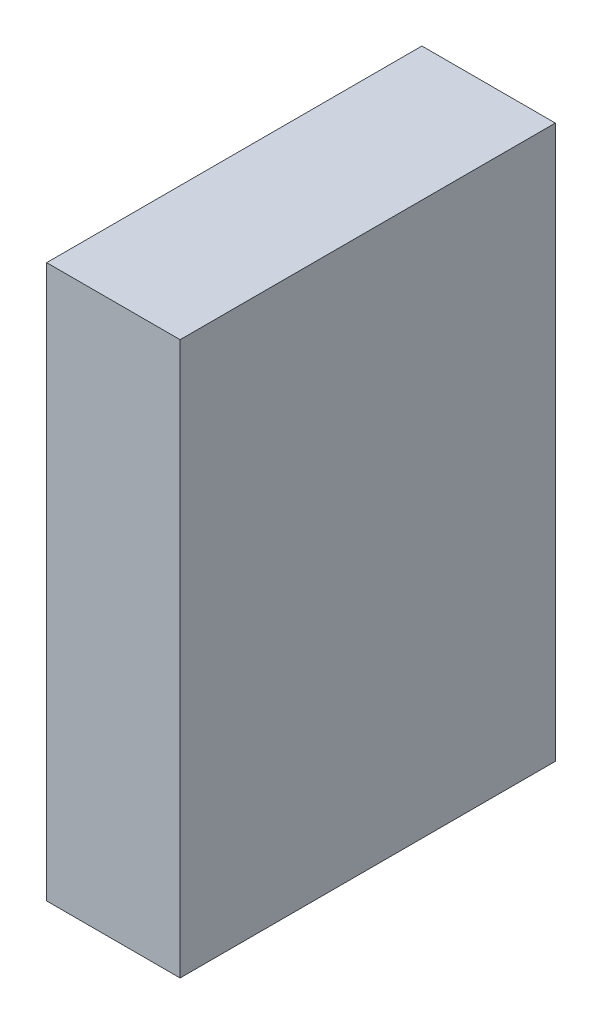
ISO-10303-21;
HEADER;
FILE_DESCRIPTION(('STEP AP214'),'2;1');
FILE_NAME('part.step','',(''),(''),'','','');
FILE_SCHEMA(('AUTOMOTIVE_DESIGN { 1 0 10303 214 1 1 1 1 }'));
ENDSEC;
DATA;
#1=APPLICATION_CONTEXT('core data for automotive mechanical design processes');
#2=APPLICATION_PROTOCOL_DEFINITION('international standard','automotive_design',2000,#1);
#3=PRODUCT_CONTEXT('',#1,'mechanical');
#4=PRODUCT('Part','Part','',(#3));
#5=PRODUCT_RELATED_PRODUCT_CATEGORY('part','',(#4));
#6=PRODUCT_DEFINITION_FORMATION('','',#4);
#7=PRODUCT_DEFINITION_CONTEXT('part definition',#1,'design');
#8=PRODUCT_DEFINITION('design','',#6,#7);
#9=PRODUCT_DEFINITION_SHAPE('','',#8);
#10=(LENGTH_UNIT() NAMED_UNIT(*) SI_UNIT(.MILLI.,.METRE.));
#11=(NAMED_UNIT(*) PLANE_ANGLE_UNIT() SI_UNIT($,.RADIAN.));
#12=(NAMED_UNIT(*) SI_UNIT($,.STERADIAN.) SOLID_ANGLE_UNIT());
#13=UNCERTAINTY_MEASURE_WITH_UNIT(LENGTH_MEASURE(1.E-05),#10,'distance_accuracy_value','');
#14=(GEOMETRIC_REPRESENTATION_CONTEXT(3) GLOBAL_UNCERTAINTY_ASSIGNED_CONTEXT((#13)) GLOBAL_UNIT_ASSIGNED_CONTEXT((#10,
#11,#12)) REPRESENTATION_CONTEXT('',''));
#15=CARTESIAN_POINT('',(0.,0.,0.));
#16=DIRECTION('',(0.,0.,1.));
#17=DIRECTION('',(1.,0.,0.));
#18=AXIS2_PLACEMENT_3D('',#15,#16,#17);
#19=CARTESIAN_POINT('',(0.,0.,1.00000054));
#20=DIRECTION('',(0.,0.,1.));
#21=DIRECTION('',(1.,0.,0.));
#22=AXIS2_PLACEMENT_3D('',#19,#20,#21);
#23=PLANE('',#22);
#24=DIRECTION('',(0.,-1.,0.));
#25=VECTOR('',#24,1.);
#26=CARTESIAN_POINT('',(-0.1778,0.7366,1.00000054));
#27=LINE('',#26,#25);
#28=CARTESIAN_POINT('',(-0.1778,0.7366,1.00000054));
#29=VERTEX_POINT('',#28);
#30=CARTESIAN_POINT('',(-0.1778,-0.7366,1.00000054));
#31=VERTEX_POINT('',#30);
#32=EDGE_CURVE('E82',#29,#31,#27,.T.);
#33=ORIENTED_EDGE('',*,*,#32,.T.);
#34=DIRECTION('',(1.,0.,0.));
#35=VECTOR('',#34,1.);
#36=CARTESIAN_POINT('',(-0.1778,-0.7366,1.00000054));
#37=LINE('',#36,#35);
#38=CARTESIAN_POINT('',(0.1778,-0.7366,1.00000054));
#39=VERTEX_POINT('',#38);
#40=EDGE_CURVE('E104',#31,#39,#37,.T.);
#41=ORIENTED_EDGE('',*,*,#40,.T.);
#42=DIRECTION('',(0.,1.,0.));
#43=VECTOR('',#42,1.);
#44=CARTESIAN_POINT('',(0.1778,-0.7366,1.00000054));
#45=LINE('',#44,#43);
#46=CARTESIAN_POINT('',(0.1778,0.7366,1.00000054));
#47=VERTEX_POINT('',#46);
#48=EDGE_CURVE('E75',#39,#47,#45,.T.);
#49=ORIENTED_EDGE('',*,*,#48,.T.);
#50=DIRECTION('',(-1.,0.,0.));
#51=VECTOR('',#50,1.);
#52=CARTESIAN_POINT('',(0.1778,0.7366,1.00000054));
#53=LINE('',#52,#51);
#54=EDGE_CURVE('E11',#47,#29,#53,.T.);
#55=ORIENTED_EDGE('',*,*,#54,.T.);
#56=EDGE_LOOP('',(#33,#41,#49,#55));
#57=FACE_BOUND('',#56,.T.);
#58=ADVANCED_FACE('F17',(#57),#23,.T.);
#59=CARTESIAN_POINT('',(0.,0.,0.));
#60=DIRECTION('',(0.,0.,1.));
#61=DIRECTION('',(1.,0.,0.));
#62=AXIS2_PLACEMENT_3D('',#59,#60,#61);
#63=PLANE('',#62);
#64=DIRECTION('',(-1.,0.,0.));
#65=VECTOR('',#64,1.);
#66=CARTESIAN_POINT('',(0.1778,0.7366,0.));
#67=LINE('',#66,#65);
#68=CARTESIAN_POINT('',(0.1778,0.7366,0.));
#69=VERTEX_POINT('',#68);
#70=CARTESIAN_POINT('',(-0.1778,0.7366,0.));
#71=VERTEX_POINT('',#70);
#72=EDGE_CURVE('E20',#69,#71,#67,.T.);
#73=ORIENTED_EDGE('',*,*,#72,.F.);
#74=DIRECTION('',(0.,1.,0.));
#75=VECTOR('',#74,1.);
#76=CARTESIAN_POINT('',(0.1778,-0.7366,0.));
#77=LINE('',#76,#75);
#78=CARTESIAN_POINT('',(0.1778,-0.7366,0.));
#79=VERTEX_POINT('',#78);
#80=EDGE_CURVE('E108',#79,#69,#77,.T.);
#81=ORIENTED_EDGE('',*,*,#80,.F.);
#82=DIRECTION('',(1.,0.,0.));
#83=VECTOR('',#82,1.);
#84=CARTESIAN_POINT('',(-0.1778,-0.7366,0.));
#85=LINE('',#84,#83);
#86=CARTESIAN_POINT('',(-0.1778,-0.7366,0.));
#87=VERTEX_POINT('',#86);
#88=EDGE_CURVE('E84',#87,#79,#85,.T.);
#89=ORIENTED_EDGE('',*,*,#88,.F.);
#90=DIRECTION('',(0.,-1.,0.));
#91=VECTOR('',#90,1.);
#92=CARTESIAN_POINT('',(-0.1778,0.7366,0.));
#93=LINE('',#92,#91);
#94=EDGE_CURVE('E80',#71,#87,#93,.T.);
#95=ORIENTED_EDGE('',*,*,#94,.F.);
#96=EDGE_LOOP('',(#73,#81,#89,#95));
#97=FACE_BOUND('',#96,.T.);
#98=ADVANCED_FACE('F86',(#97),#63,.F.);
#99=CARTESIAN_POINT('',(0.1778,0.7366,0.));
#100=DIRECTION('',(0.,-1.,0.));
#101=DIRECTION('',(0.,0.,-1.));
#102=AXIS2_PLACEMENT_3D('',#99,#100,#101);
#103=PLANE('',#102);
#104=ORIENTED_EDGE('',*,*,#72,.T.);
#105=DIRECTION('',(0.,0.,1.));
#106=VECTOR('',#105,1.);
#107=CARTESIAN_POINT('',(-0.1778,0.7366,0.));
#108=LINE('',#107,#106);
#109=EDGE_CURVE('E69',#71,#29,#108,.T.);
#110=ORIENTED_EDGE('',*,*,#109,.T.);
#111=ORIENTED_EDGE('',*,*,#54,.F.);
#112=DIRECTION('',(0.,0.,1.));
#113=VECTOR('',#112,1.);
#114=CARTESIAN_POINT('',(0.1778,0.7366,0.));
#115=LINE('',#114,#113);
#116=EDGE_CURVE('E72',#69,#47,#115,.T.);
#117=ORIENTED_EDGE('',*,*,#116,.F.);
#118=EDGE_LOOP('',(#104,#110,#111,#117));
#119=FACE_BOUND('',#118,.T.);
#120=ADVANCED_FACE('F68',(#119),#103,.F.);
#121=CARTESIAN_POINT('',(0.1778,-0.7366,0.));
#122=DIRECTION('',(-1.,0.,0.));
#123=DIRECTION('',(0.,0.,1.));
#124=AXIS2_PLACEMENT_3D('',#121,#122,#123);
#125=PLANE('',#124);
#126=ORIENTED_EDGE('',*,*,#80,.T.);
#127=ORIENTED_EDGE('',*,*,#116,.T.);
#128=ORIENTED_EDGE('',*,*,#48,.F.);
#129=DIRECTION('',(0.,0.,1.));
#130=VECTOR('',#129,1.);
#131=CARTESIAN_POINT('',(0.1778,-0.7366,0.));
#132=LINE('',#131,#130);
#133=EDGE_CURVE('E99',#79,#39,#132,.T.);
#134=ORIENTED_EDGE('',*,*,#133,.F.);
#135=EDGE_LOOP('',(#126,#127,#128,#134));
#136=FACE_BOUND('',#135,.T.);
#137=ADVANCED_FACE('F117',(#136),#125,.F.);
#138=CARTESIAN_POINT('',(-0.1778,-0.7366,0.));
#139=DIRECTION('',(0.,1.,0.));
#140=DIRECTION('',(1.,0.,0.));
#141=AXIS2_PLACEMENT_3D('',#138,#139,#140);
#142=PLANE('',#141);
#143=ORIENTED_EDGE('',*,*,#88,.T.);
#144=ORIENTED_EDGE('',*,*,#133,.T.);
#145=ORIENTED_EDGE('',*,*,#40,.F.);
#146=DIRECTION('',(0.,0.,1.));
#147=VECTOR('',#146,1.);
#148=CARTESIAN_POINT('',(-0.1778,-0.7366,0.));
#149=LINE('',#148,#147);
#150=EDGE_CURVE('E90',#87,#31,#149,.T.);
#151=ORIENTED_EDGE('',*,*,#150,.F.);
#152=EDGE_LOOP('',(#143,#144,#145,#151));
#153=FACE_BOUND('',#152,.T.);
#154=ADVANCED_FACE('F119',(#153),#142,.F.);
#155=CARTESIAN_POINT('',(-0.1778,0.7366,0.));
#156=DIRECTION('',(1.,0.,0.));
#157=DIRECTION('',(0.,1.,0.));
#158=AXIS2_PLACEMENT_3D('',#155,#156,#157);
#159=PLANE('',#158);
#160=ORIENTED_EDGE('',*,*,#94,.T.);
#161=ORIENTED_EDGE('',*,*,#150,.T.);
#162=ORIENTED_EDGE('',*,*,#32,.F.);
#163=ORIENTED_EDGE('',*,*,#109,.F.);
#164=EDGE_LOOP('',(#160,#161,#162,#163));
#165=FACE_BOUND('',#164,.T.);
#166=ADVANCED_FACE('F78',(#165),#159,.F.);
#167=CLOSED_SHELL('',(#58,#98,#120,#137,#154,#166));
#168=MANIFOLD_SOLID_BREP('B1',#167);
#169=ADVANCED_BREP_SHAPE_REPRESENTATION('',(#18,#168),#14);
#170=SHAPE_DEFINITION_REPRESENTATION(#9,#169);
ENDSEC;
END-ISO-10303-21;
